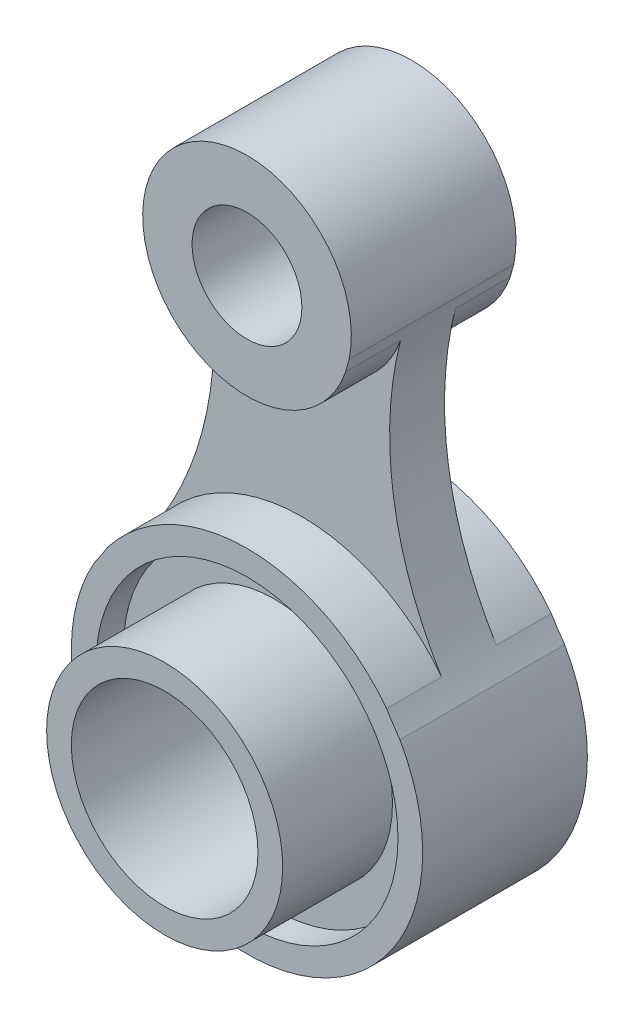
ISO-10303-21;
HEADER;
FILE_DESCRIPTION(('STEP AP214'),'2;1');
FILE_NAME('part.step','',(''),(''),'','','');
FILE_SCHEMA(('AUTOMOTIVE_DESIGN { 1 0 10303 214 1 1 1 1 }'));
ENDSEC;
DATA;
#1=APPLICATION_CONTEXT('core data for automotive mechanical design processes');
#2=APPLICATION_PROTOCOL_DEFINITION('international standard','automotive_design',2000,#1);
#3=PRODUCT_CONTEXT('',#1,'mechanical');
#4=PRODUCT('Part','Part','',(#3));
#5=PRODUCT_RELATED_PRODUCT_CATEGORY('part','',(#4));
#6=PRODUCT_DEFINITION_FORMATION('','',#4);
#7=PRODUCT_DEFINITION_CONTEXT('part definition',#1,'design');
#8=PRODUCT_DEFINITION('design','',#6,#7);
#9=PRODUCT_DEFINITION_SHAPE('','',#8);
#10=(LENGTH_UNIT() NAMED_UNIT(*) SI_UNIT(.MILLI.,.METRE.));
#11=(NAMED_UNIT(*) PLANE_ANGLE_UNIT() SI_UNIT($,.RADIAN.));
#12=(NAMED_UNIT(*) SI_UNIT($,.STERADIAN.) SOLID_ANGLE_UNIT());
#13=UNCERTAINTY_MEASURE_WITH_UNIT(LENGTH_MEASURE(1.E-05),#10,'distance_accuracy_value','');
#14=(GEOMETRIC_REPRESENTATION_CONTEXT(3) GLOBAL_UNCERTAINTY_ASSIGNED_CONTEXT((#13)) GLOBAL_UNIT_ASSIGNED_CONTEXT((#10,
#11,#12)) REPRESENTATION_CONTEXT('',''));
#15=CARTESIAN_POINT('',(0.,0.,0.));
#16=DIRECTION('',(0.,0.,1.));
#17=DIRECTION('',(1.,0.,0.));
#18=AXIS2_PLACEMENT_3D('',#15,#16,#17);
#19=CARTESIAN_POINT('',(80.2238614442222,52.9633260020108,10.));
#20=DIRECTION('',(0.,0.,-1.));
#21=DIRECTION('',(-1.,0.,0.));
#22=AXIS2_PLACEMENT_3D('',#19,#20,#21);
#23=CYLINDRICAL_SURFACE('',#22,64.2449236501036);
#24=CARTESIAN_POINT('',(80.2238614442222,52.9633260020108,0.));
#25=DIRECTION('',(0.,0.,1.));
#26=DIRECTION('',(1.,0.,0.));
#27=AXIS2_PLACEMENT_3D('',#24,#25,#26);
#28=CIRCLE('',#27,64.2449236501036);
#29=CARTESIAN_POINT('',(25.4209864442221,19.4363949384313,0.));
#30=VERTEX_POINT('',#29);
#31=CARTESIAN_POINT('',(17.9656021491115,68.816381365265,0.));
#32=VERTEX_POINT('',#31);
#33=EDGE_CURVE('E262',#30,#32,#28,.F.);
#34=ORIENTED_EDGE('',*,*,#33,.T.);
#35=DIRECTION('',(0.,0.,1.));
#36=VECTOR('',#35,1.);
#37=CARTESIAN_POINT('',(17.9656021491115,68.816381365265,-10.));
#38=LINE('',#37,#36);
#39=CARTESIAN_POINT('',(17.9656021491115,68.816381365265,-10.));
#40=VERTEX_POINT('',#39);
#41=EDGE_CURVE('E78',#40,#32,#38,.T.);
#42=ORIENTED_EDGE('',*,*,#41,.F.);
#43=CARTESIAN_POINT('',(80.2238614442222,52.9633260020108,-10.));
#44=DIRECTION('',(0.,0.,1.));
#45=DIRECTION('',(1.,0.,0.));
#46=AXIS2_PLACEMENT_3D('',#43,#44,#45);
#47=CIRCLE('',#46,64.2449236501036);
#48=CARTESIAN_POINT('',(18.6034567656696,71.1384722753991,-10.));
#49=VERTEX_POINT('',#48);
#50=EDGE_CURVE('E191',#40,#49,#47,.F.);
#51=ORIENTED_EDGE('',*,*,#50,.T.);
#52=DIRECTION('',(0.,0.,1.));
#53=VECTOR('',#52,1.);
#54=CARTESIAN_POINT('',(18.6034567656696,71.1384722753991,-10.));
#55=LINE('',#54,#53);
#56=CARTESIAN_POINT('',(18.6034567656696,71.1384722753991,20.));
#57=VERTEX_POINT('',#56);
#58=EDGE_CURVE('E161',#49,#57,#55,.T.);
#59=ORIENTED_EDGE('',*,*,#58,.T.);
#60=CARTESIAN_POINT('',(80.2238614442222,52.9633260020108,20.));
#61=DIRECTION('',(0.,0.,1.));
#62=DIRECTION('',(1.,0.,0.));
#63=AXIS2_PLACEMENT_3D('',#60,#61,#62);
#64=CIRCLE('',#63,64.2449236501036);
#65=CARTESIAN_POINT('',(17.9656021491115,68.816381365265,20.));
#66=VERTEX_POINT('',#65);
#67=EDGE_CURVE('E159',#66,#57,#64,.F.);
#68=ORIENTED_EDGE('',*,*,#67,.F.);
#69=CARTESIAN_POINT('',(17.9656021491115,68.816381365265,10.));
#70=VERTEX_POINT('',#69);
#71=EDGE_CURVE('E145',#70,#66,#38,.T.);
#72=ORIENTED_EDGE('',*,*,#71,.F.);
#73=CARTESIAN_POINT('',(80.2238614442222,52.9633260020108,10.));
#74=DIRECTION('',(0.,0.,1.));
#75=DIRECTION('',(1.,0.,0.));
#76=AXIS2_PLACEMENT_3D('',#73,#74,#75);
#77=CIRCLE('',#76,64.2449236501036);
#78=CARTESIAN_POINT('',(25.4209864442221,19.4363949384313,10.));
#79=VERTEX_POINT('',#78);
#80=EDGE_CURVE('E255',#79,#70,#77,.F.);
#81=ORIENTED_EDGE('',*,*,#80,.F.);
#82=DIRECTION('',(0.,0.,1.));
#83=VECTOR('',#82,1.);
#84=CARTESIAN_POINT('',(25.4209864442221,19.4363949384313,-10.));
#85=LINE('',#84,#83);
#86=CARTESIAN_POINT('',(25.4209864442221,19.4363949384313,20.));
#87=VERTEX_POINT('',#86);
#88=EDGE_CURVE('E249',#79,#87,#85,.T.);
#89=ORIENTED_EDGE('',*,*,#88,.T.);
#90=CARTESIAN_POINT('',(80.2238614442222,52.9633260020108,20.));
#91=DIRECTION('',(0.,0.,1.));
#92=DIRECTION('',(1.,0.,0.));
#93=AXIS2_PLACEMENT_3D('',#90,#91,#92);
#94=CIRCLE('',#93,64.2449236501036);
#95=CARTESIAN_POINT('',(27.86119767388,15.7401926346847,20.));
#96=VERTEX_POINT('',#95);
#97=EDGE_CURVE('E216',#96,#87,#94,.F.);
#98=ORIENTED_EDGE('',*,*,#97,.F.);
#99=DIRECTION('',(0.,0.,1.));
#100=VECTOR('',#99,1.);
#101=CARTESIAN_POINT('',(27.86119767388,15.7401926346847,-10.));
#102=LINE('',#101,#100);
#103=CARTESIAN_POINT('',(27.86119767388,15.7401926346847,-10.));
#104=VERTEX_POINT('',#103);
#105=EDGE_CURVE('E237',#104,#96,#102,.T.);
#106=ORIENTED_EDGE('',*,*,#105,.F.);
#107=CARTESIAN_POINT('',(80.2238614442222,52.9633260020108,-10.));
#108=DIRECTION('',(0.,0.,1.));
#109=DIRECTION('',(1.,0.,0.));
#110=AXIS2_PLACEMENT_3D('',#107,#108,#109);
#111=CIRCLE('',#110,64.2449236501036);
#112=CARTESIAN_POINT('',(25.4209864442221,19.4363949384313,-10.));
#113=VERTEX_POINT('',#112);
#114=EDGE_CURVE('E229',#104,#113,#111,.F.);
#115=ORIENTED_EDGE('',*,*,#114,.T.);
#116=EDGE_CURVE('E245',#113,#30,#85,.T.);
#117=ORIENTED_EDGE('',*,*,#116,.T.);
#118=EDGE_LOOP('',(#34,#42,#51,#59,#68,#72,#81,#89,#98,#106,#115,#117));
#119=FACE_BOUND('',#118,.T.);
#120=ADVANCED_FACE('F53',(#119),#23,.F.);
#121=CARTESIAN_POINT('',(-80.2238614442222,52.9633260020108,10.));
#122=DIRECTION('',(0.,0.,-1.));
#123=DIRECTION('',(-1.,0.,0.));
#124=AXIS2_PLACEMENT_3D('',#121,#122,#123);
#125=CYLINDRICAL_SURFACE('',#124,64.2449236501036);
#126=CARTESIAN_POINT('',(-80.2238614442222,52.9633260020108,0.));
#127=DIRECTION('',(0.,0.,1.));
#128=DIRECTION('',(1.,0.,0.));
#129=AXIS2_PLACEMENT_3D('',#126,#127,#128);
#130=CIRCLE('',#129,64.2449236501036);
#131=CARTESIAN_POINT('',(-25.4209864442221,19.4363949384313,0.));
#132=VERTEX_POINT('',#131);
#133=CARTESIAN_POINT('',(-17.9656021491115,68.816381365265,0.));
#134=VERTEX_POINT('',#133);
#135=EDGE_CURVE('E56',#132,#134,#130,.T.);
#136=ORIENTED_EDGE('',*,*,#135,.F.);
#137=DIRECTION('',(0.,0.,1.));
#138=VECTOR('',#137,1.);
#139=CARTESIAN_POINT('',(-25.4209864442221,19.4363949384313,-10.));
#140=LINE('',#139,#138);
#141=CARTESIAN_POINT('',(-25.4209864442221,19.4363949384313,-10.));
#142=VERTEX_POINT('',#141);
#143=EDGE_CURVE('E70',#142,#132,#140,.T.);
#144=ORIENTED_EDGE('',*,*,#143,.F.);
#145=CARTESIAN_POINT('',(-80.2238614442222,52.9633260020108,-10.));
#146=DIRECTION('',(0.,0.,1.));
#147=DIRECTION('',(1.,0.,0.));
#148=AXIS2_PLACEMENT_3D('',#145,#146,#147);
#149=CIRCLE('',#148,64.2449236501036);
#150=CARTESIAN_POINT('',(-27.86119767388,15.7401926346847,-10.));
#151=VERTEX_POINT('',#150);
#152=EDGE_CURVE('E234',#151,#142,#149,.T.);
#153=ORIENTED_EDGE('',*,*,#152,.F.);
#154=DIRECTION('',(0.,0.,1.));
#155=VECTOR('',#154,1.);
#156=CARTESIAN_POINT('',(-27.86119767388,15.7401926346847,-10.));
#157=LINE('',#156,#155);
#158=CARTESIAN_POINT('',(-27.86119767388,15.7401926346847,20.));
#159=VERTEX_POINT('',#158);
#160=EDGE_CURVE('E238',#151,#159,#157,.T.);
#161=ORIENTED_EDGE('',*,*,#160,.T.);
#162=CARTESIAN_POINT('',(-80.2238614442222,52.9633260020108,20.));
#163=DIRECTION('',(0.,0.,1.));
#164=DIRECTION('',(1.,0.,0.));
#165=AXIS2_PLACEMENT_3D('',#162,#163,#164);
#166=CIRCLE('',#165,64.2449236501036);
#167=CARTESIAN_POINT('',(-25.4209864442221,19.4363949384313,20.));
#168=VERTEX_POINT('',#167);
#169=EDGE_CURVE('E221',#159,#168,#166,.T.);
#170=ORIENTED_EDGE('',*,*,#169,.T.);
#171=CARTESIAN_POINT('',(-25.4209864442221,19.4363949384313,10.));
#172=VERTEX_POINT('',#171);
#173=EDGE_CURVE('E244',#172,#168,#140,.T.);
#174=ORIENTED_EDGE('',*,*,#173,.F.);
#175=CARTESIAN_POINT('',(-80.2238614442222,52.9633260020108,10.));
#176=DIRECTION('',(0.,0.,1.));
#177=DIRECTION('',(1.,0.,0.));
#178=AXIS2_PLACEMENT_3D('',#175,#176,#177);
#179=CIRCLE('',#178,64.2449236501036);
#180=CARTESIAN_POINT('',(-17.9656021491115,68.816381365265,10.));
#181=VERTEX_POINT('',#180);
#182=EDGE_CURVE('E11',#172,#181,#179,.T.);
#183=ORIENTED_EDGE('',*,*,#182,.T.);
#184=DIRECTION('',(0.,0.,1.));
#185=VECTOR('',#184,1.);
#186=CARTESIAN_POINT('',(-17.9656021491115,68.816381365265,-10.));
#187=LINE('',#186,#185);
#188=CARTESIAN_POINT('',(-17.9656021491115,68.816381365265,20.));
#189=VERTEX_POINT('',#188);
#190=EDGE_CURVE('E202',#181,#189,#187,.T.);
#191=ORIENTED_EDGE('',*,*,#190,.T.);
#192=CARTESIAN_POINT('',(-80.2238614442222,52.9633260020108,20.));
#193=DIRECTION('',(0.,0.,1.));
#194=DIRECTION('',(1.,0.,0.));
#195=AXIS2_PLACEMENT_3D('',#192,#193,#194);
#196=CIRCLE('',#195,64.2449236501036);
#197=CARTESIAN_POINT('',(-18.6034567656696,71.1384722753991,20.));
#198=VERTEX_POINT('',#197);
#199=EDGE_CURVE('E170',#189,#198,#196,.T.);
#200=ORIENTED_EDGE('',*,*,#199,.T.);
#201=DIRECTION('',(0.,0.,1.));
#202=VECTOR('',#201,1.);
#203=CARTESIAN_POINT('',(-18.6034567656696,71.1384722753991,-10.));
#204=LINE('',#203,#202);
#205=CARTESIAN_POINT('',(-18.6034567656696,71.1384722753991,-10.));
#206=VERTEX_POINT('',#205);
#207=EDGE_CURVE('E203',#206,#198,#204,.T.);
#208=ORIENTED_EDGE('',*,*,#207,.F.);
#209=CARTESIAN_POINT('',(-80.2238614442222,52.9633260020108,-10.));
#210=DIRECTION('',(0.,0.,1.));
#211=DIRECTION('',(1.,0.,0.));
#212=AXIS2_PLACEMENT_3D('',#209,#210,#211);
#213=CIRCLE('',#212,64.2449236501036);
#214=CARTESIAN_POINT('',(-17.9656021491115,68.816381365265,-10.));
#215=VERTEX_POINT('',#214);
#216=EDGE_CURVE('E156',#215,#206,#213,.T.);
#217=ORIENTED_EDGE('',*,*,#216,.F.);
#218=EDGE_CURVE('E197',#215,#134,#187,.T.);
#219=ORIENTED_EDGE('',*,*,#218,.T.);
#220=EDGE_LOOP('',(#136,#144,#153,#161,#170,#174,#183,#191,#200,#208,#217,#219));
#221=FACE_BOUND('',#220,.T.);
#222=ADVANCED_FACE('F273',(#221),#125,.F.);
#223=CARTESIAN_POINT('',(0.,0.,10.));
#224=DIRECTION('',(0.,0.,1.));
#225=DIRECTION('',(1.,0.,0.));
#226=AXIS2_PLACEMENT_3D('',#223,#224,#225);
#227=PLANE('',#226);
#228=CARTESIAN_POINT('',(0.,0.,10.));
#229=DIRECTION('',(0.,0.,1.));
#230=DIRECTION('',(1.,0.,0.));
#231=AXIS2_PLACEMENT_3D('',#228,#229,#230);
#232=CIRCLE('',#231,32.);
#233=EDGE_CURVE('E252',#79,#172,#232,.T.);
#234=ORIENTED_EDGE('',*,*,#233,.F.);
#235=ORIENTED_EDGE('',*,*,#80,.T.);
#236=CARTESIAN_POINT('',(0.,75.,10.));
#237=DIRECTION('',(0.,0.,1.));
#238=DIRECTION('',(1.,0.,0.));
#239=AXIS2_PLACEMENT_3D('',#236,#237,#238);
#240=CIRCLE('',#239,19.);
#241=EDGE_CURVE('E62',#181,#70,#240,.T.);
#242=ORIENTED_EDGE('',*,*,#241,.F.);
#243=ORIENTED_EDGE('',*,*,#182,.F.);
#244=EDGE_LOOP('',(#234,#235,#242,#243));
#245=FACE_BOUND('',#244,.T.);
#246=ADVANCED_FACE('F313',(#245),#227,.T.);
#247=CARTESIAN_POINT('',(0.,0.,0.));
#248=DIRECTION('',(0.,0.,1.));
#249=DIRECTION('',(1.,0.,0.));
#250=AXIS2_PLACEMENT_3D('',#247,#248,#249);
#251=PLANE('',#250);
#252=CARTESIAN_POINT('',(0.,0.,0.));
#253=DIRECTION('',(0.,0.,1.));
#254=DIRECTION('',(1.,0.,0.));
#255=AXIS2_PLACEMENT_3D('',#252,#253,#254);
#256=CIRCLE('',#255,32.);
#257=EDGE_CURVE('E241',#30,#132,#256,.T.);
#258=ORIENTED_EDGE('',*,*,#257,.T.);
#259=ORIENTED_EDGE('',*,*,#135,.T.);
#260=CARTESIAN_POINT('',(0.,75.,0.));
#261=DIRECTION('',(0.,0.,1.));
#262=DIRECTION('',(1.,0.,0.));
#263=AXIS2_PLACEMENT_3D('',#260,#261,#262);
#264=CIRCLE('',#263,19.);
#265=EDGE_CURVE('E264',#134,#32,#264,.T.);
#266=ORIENTED_EDGE('',*,*,#265,.T.);
#267=ORIENTED_EDGE('',*,*,#33,.F.);
#268=EDGE_LOOP('',(#258,#259,#266,#267));
#269=FACE_BOUND('',#268,.T.);
#270=ADVANCED_FACE('F272',(#269),#251,.F.);
#271=CARTESIAN_POINT('',(0.,0.,-10.));
#272=DIRECTION('',(0.,0.,1.));
#273=DIRECTION('',(1.,0.,0.));
#274=AXIS2_PLACEMENT_3D('',#271,#272,#273);
#275=CYLINDRICAL_SURFACE('',#274,32.);
#276=ORIENTED_EDGE('',*,*,#257,.F.);
#277=ORIENTED_EDGE('',*,*,#116,.F.);
#278=CARTESIAN_POINT('',(0.,0.,-10.));
#279=DIRECTION('',(0.,0.,1.));
#280=DIRECTION('',(1.,0.,0.));
#281=AXIS2_PLACEMENT_3D('',#278,#279,#280);
#282=CIRCLE('',#281,32.);
#283=EDGE_CURVE('E230',#113,#142,#282,.T.);
#284=ORIENTED_EDGE('',*,*,#283,.T.);
#285=ORIENTED_EDGE('',*,*,#143,.T.);
#286=EDGE_LOOP('',(#276,#277,#284,#285));
#287=FACE_BOUND('',#286,.T.);
#288=ADVANCED_FACE('F285',(#287),#275,.T.);
#289=ORIENTED_EDGE('',*,*,#105,.T.);
#290=CARTESIAN_POINT('',(0.,0.,20.));
#291=DIRECTION('',(0.,0.,1.));
#292=DIRECTION('',(1.,0.,0.));
#293=AXIS2_PLACEMENT_3D('',#290,#291,#292);
#294=CIRCLE('',#293,32.);
#295=EDGE_CURVE('E212',#159,#96,#294,.T.);
#296=ORIENTED_EDGE('',*,*,#295,.F.);
#297=ORIENTED_EDGE('',*,*,#160,.F.);
#298=EDGE_CURVE('E225',#151,#104,#282,.T.);
#299=ORIENTED_EDGE('',*,*,#298,.T.);
#300=EDGE_LOOP('',(#289,#296,#297,#299));
#301=FACE_BOUND('',#300,.T.);
#302=ADVANCED_FACE('F329',(#301),#275,.T.);
#303=ORIENTED_EDGE('',*,*,#88,.F.);
#304=ORIENTED_EDGE('',*,*,#233,.T.);
#305=ORIENTED_EDGE('',*,*,#173,.T.);
#306=EDGE_CURVE('E217',#87,#168,#294,.T.);
#307=ORIENTED_EDGE('',*,*,#306,.F.);
#308=EDGE_LOOP('',(#303,#304,#305,#307));
#309=FACE_BOUND('',#308,.T.);
#310=ADVANCED_FACE('F325',(#309),#275,.T.);
#311=CARTESIAN_POINT('',(0.,0.,-10.));
#312=DIRECTION('',(0.,0.,1.));
#313=DIRECTION('',(1.,0.,0.));
#314=AXIS2_PLACEMENT_3D('',#311,#312,#313);
#315=CYLINDRICAL_SURFACE('',#314,27.5);
#316=CARTESIAN_POINT('',(0.,0.,15.));
#317=DIRECTION('',(0.,0.,1.));
#318=DIRECTION('',(1.,0.,0.));
#319=AXIS2_PLACEMENT_3D('',#316,#317,#318);
#320=CIRCLE('',#319,27.5);
#321=CARTESIAN_POINT('',(27.5,0.,15.));
#322=VERTEX_POINT('',#321);
#323=EDGE_CURVE('E176',#322,#322,#320,.T.);
#324=ORIENTED_EDGE('',*,*,#323,.F.);
#325=EDGE_LOOP('',(#324));
#326=FACE_BOUND('',#325,.T.);
#327=CARTESIAN_POINT('',(0.,0.,20.));
#328=DIRECTION('',(0.,0.,1.));
#329=DIRECTION('',(1.,0.,0.));
#330=AXIS2_PLACEMENT_3D('',#327,#328,#329);
#331=CIRCLE('',#330,27.5);
#332=CARTESIAN_POINT('',(27.5,0.,20.));
#333=VERTEX_POINT('',#332);
#334=EDGE_CURVE('E201',#333,#333,#331,.T.);
#335=ORIENTED_EDGE('',*,*,#334,.T.);
#336=EDGE_LOOP('',(#335));
#337=FACE_BOUND('',#336,.T.);
#338=ADVANCED_FACE('F322',(#326,#337),#315,.F.);
#339=CARTESIAN_POINT('',(0.,0.,-10.));
#340=DIRECTION('',(0.,0.,1.));
#341=DIRECTION('',(1.,0.,0.));
#342=AXIS2_PLACEMENT_3D('',#339,#340,#341);
#343=PLANE('',#342);
#344=ORIENTED_EDGE('',*,*,#298,.F.);
#345=ORIENTED_EDGE('',*,*,#152,.T.);
#346=ORIENTED_EDGE('',*,*,#283,.F.);
#347=ORIENTED_EDGE('',*,*,#114,.F.);
#348=EDGE_LOOP('',(#344,#345,#346,#347));
#349=FACE_BOUND('',#348,.T.);
#350=CARTESIAN_POINT('',(0.,0.,-10.));
#351=DIRECTION('',(0.,0.,1.));
#352=DIRECTION('',(1.,0.,0.));
#353=AXIS2_PLACEMENT_3D('',#350,#351,#352);
#354=CIRCLE('',#353,17.);
#355=CARTESIAN_POINT('',(17.,0.,-10.));
#356=VERTEX_POINT('',#355);
#357=EDGE_CURVE('E591',#356,#356,#354,.T.);
#358=ORIENTED_EDGE('',*,*,#357,.T.);
#359=EDGE_LOOP('',(#358));
#360=FACE_BOUND('',#359,.T.);
#361=ADVANCED_FACE('F288',(#349,#360),#343,.F.);
#362=CARTESIAN_POINT('',(0.,0.,20.));
#363=DIRECTION('',(0.,0.,1.));
#364=DIRECTION('',(1.,0.,0.));
#365=AXIS2_PLACEMENT_3D('',#362,#363,#364);
#366=PLANE('',#365);
#367=ORIENTED_EDGE('',*,*,#334,.F.);
#368=EDGE_LOOP('',(#367));
#369=FACE_BOUND('',#368,.T.);
#370=ORIENTED_EDGE('',*,*,#295,.T.);
#371=ORIENTED_EDGE('',*,*,#97,.T.);
#372=ORIENTED_EDGE('',*,*,#306,.T.);
#373=ORIENTED_EDGE('',*,*,#169,.F.);
#374=EDGE_LOOP('',(#370,#371,#372,#373));
#375=FACE_BOUND('',#374,.T.);
#376=ADVANCED_FACE('F308',(#369,#375),#366,.T.);
#377=CARTESIAN_POINT('',(0.,75.,-10.));
#378=DIRECTION('',(0.,0.,1.));
#379=DIRECTION('',(1.,0.,0.));
#380=AXIS2_PLACEMENT_3D('',#377,#378,#379);
#381=CYLINDRICAL_SURFACE('',#380,19.);
#382=ORIENTED_EDGE('',*,*,#265,.F.);
#383=ORIENTED_EDGE('',*,*,#218,.F.);
#384=CARTESIAN_POINT('',(0.,75.,-10.));
#385=DIRECTION('',(0.,0.,1.));
#386=DIRECTION('',(1.,0.,0.));
#387=AXIS2_PLACEMENT_3D('',#384,#385,#386);
#388=CIRCLE('',#387,19.);
#389=EDGE_CURVE('E186',#215,#40,#388,.T.);
#390=ORIENTED_EDGE('',*,*,#389,.T.);
#391=ORIENTED_EDGE('',*,*,#41,.T.);
#392=EDGE_LOOP('',(#382,#383,#390,#391));
#393=FACE_BOUND('',#392,.T.);
#394=ADVANCED_FACE('F277',(#393),#381,.T.);
#395=ORIENTED_EDGE('',*,*,#190,.F.);
#396=ORIENTED_EDGE('',*,*,#241,.T.);
#397=ORIENTED_EDGE('',*,*,#71,.T.);
#398=CARTESIAN_POINT('',(0.,75.,20.));
#399=DIRECTION('',(0.,0.,1.));
#400=DIRECTION('',(1.,0.,0.));
#401=AXIS2_PLACEMENT_3D('',#398,#399,#400);
#402=CIRCLE('',#401,19.);
#403=EDGE_CURVE('E149',#189,#66,#402,.T.);
#404=ORIENTED_EDGE('',*,*,#403,.F.);
#405=EDGE_LOOP('',(#395,#396,#397,#404));
#406=FACE_BOUND('',#405,.T.);
#407=ADVANCED_FACE('F147',(#406),#381,.T.);
#408=ORIENTED_EDGE('',*,*,#207,.T.);
#409=EDGE_CURVE('E166',#57,#198,#402,.T.);
#410=ORIENTED_EDGE('',*,*,#409,.F.);
#411=ORIENTED_EDGE('',*,*,#58,.F.);
#412=EDGE_CURVE('E192',#49,#206,#388,.T.);
#413=ORIENTED_EDGE('',*,*,#412,.T.);
#414=EDGE_LOOP('',(#408,#410,#411,#413));
#415=FACE_BOUND('',#414,.T.);
#416=ADVANCED_FACE('F296',(#415),#381,.T.);
#417=CARTESIAN_POINT('',(0.,75.,-10.));
#418=DIRECTION('',(0.,0.,1.));
#419=DIRECTION('',(1.,0.,0.));
#420=AXIS2_PLACEMENT_3D('',#417,#418,#419);
#421=CYLINDRICAL_SURFACE('',#420,10.);
#422=CARTESIAN_POINT('',(0.,75.,-10.));
#423=DIRECTION('',(0.,0.,1.));
#424=DIRECTION('',(1.,0.,0.));
#425=AXIS2_PLACEMENT_3D('',#422,#423,#424);
#426=CIRCLE('',#425,10.);
#427=CARTESIAN_POINT('',(10.,75.,-10.));
#428=VERTEX_POINT('',#427);
#429=EDGE_CURVE('E180',#428,#428,#426,.T.);
#430=ORIENTED_EDGE('',*,*,#429,.F.);
#431=EDGE_LOOP('',(#430));
#432=FACE_BOUND('',#431,.T.);
#433=CARTESIAN_POINT('',(0.,75.,20.));
#434=DIRECTION('',(0.,0.,1.));
#435=DIRECTION('',(1.,0.,0.));
#436=AXIS2_PLACEMENT_3D('',#433,#434,#435);
#437=CIRCLE('',#436,10.);
#438=CARTESIAN_POINT('',(10.,75.,20.));
#439=VERTEX_POINT('',#438);
#440=EDGE_CURVE('E172',#439,#439,#437,.T.);
#441=ORIENTED_EDGE('',*,*,#440,.T.);
#442=EDGE_LOOP('',(#441));
#443=FACE_BOUND('',#442,.T.);
#444=ADVANCED_FACE('F298',(#432,#443),#421,.F.);
#445=CARTESIAN_POINT('',(0.,0.,-10.));
#446=DIRECTION('',(0.,0.,1.));
#447=DIRECTION('',(1.,0.,0.));
#448=AXIS2_PLACEMENT_3D('',#445,#446,#447);
#449=PLANE('',#448);
#450=ORIENTED_EDGE('',*,*,#429,.T.);
#451=EDGE_LOOP('',(#450));
#452=FACE_BOUND('',#451,.T.);
#453=ORIENTED_EDGE('',*,*,#389,.F.);
#454=ORIENTED_EDGE('',*,*,#216,.T.);
#455=ORIENTED_EDGE('',*,*,#412,.F.);
#456=ORIENTED_EDGE('',*,*,#50,.F.);
#457=EDGE_LOOP('',(#453,#454,#455,#456));
#458=FACE_BOUND('',#457,.T.);
#459=ADVANCED_FACE('F280',(#452,#458),#449,.F.);
#460=CARTESIAN_POINT('',(0.,0.,20.));
#461=DIRECTION('',(0.,0.,1.));
#462=DIRECTION('',(1.,0.,0.));
#463=AXIS2_PLACEMENT_3D('',#460,#461,#462);
#464=PLANE('',#463);
#465=ORIENTED_EDGE('',*,*,#440,.F.);
#466=EDGE_LOOP('',(#465));
#467=FACE_BOUND('',#466,.T.);
#468=ORIENTED_EDGE('',*,*,#403,.T.);
#469=ORIENTED_EDGE('',*,*,#67,.T.);
#470=ORIENTED_EDGE('',*,*,#409,.T.);
#471=ORIENTED_EDGE('',*,*,#199,.F.);
#472=EDGE_LOOP('',(#468,#469,#470,#471));
#473=FACE_BOUND('',#472,.T.);
#474=ADVANCED_FACE('F168',(#467,#473),#464,.T.);
#475=CARTESIAN_POINT('',(0.,0.,15.));
#476=DIRECTION('',(0.,0.,1.));
#477=DIRECTION('',(1.,0.,0.));
#478=AXIS2_PLACEMENT_3D('',#475,#476,#477);
#479=PLANE('',#478);
#480=CARTESIAN_POINT('',(0.,0.,15.));
#481=DIRECTION('',(0.,0.,1.));
#482=DIRECTION('',(1.,0.,0.));
#483=AXIS2_PLACEMENT_3D('',#480,#481,#482);
#484=CIRCLE('',#483,21.5);
#485=CARTESIAN_POINT('',(21.5,0.,15.));
#486=VERTEX_POINT('',#485);
#487=EDGE_CURVE('E596',#486,#486,#484,.T.);
#488=ORIENTED_EDGE('',*,*,#487,.F.);
#489=EDGE_LOOP('',(#488));
#490=FACE_BOUND('',#489,.T.);
#491=ORIENTED_EDGE('',*,*,#323,.T.);
#492=EDGE_LOOP('',(#491));
#493=FACE_BOUND('',#492,.T.);
#494=ADVANCED_FACE('F485',(#490,#493),#479,.T.);
#495=CARTESIAN_POINT('',(0.,0.,-10.));
#496=DIRECTION('',(0.,0.,1.));
#497=DIRECTION('',(1.,0.,0.));
#498=AXIS2_PLACEMENT_3D('',#495,#496,#497);
#499=CYLINDRICAL_SURFACE('',#498,17.);
#500=ORIENTED_EDGE('',*,*,#357,.F.);
#501=EDGE_LOOP('',(#500));
#502=FACE_BOUND('',#501,.T.);
#503=CARTESIAN_POINT('',(0.,0.,35.));
#504=DIRECTION('',(0.,0.,1.));
#505=DIRECTION('',(1.,0.,0.));
#506=AXIS2_PLACEMENT_3D('',#503,#504,#505);
#507=CIRCLE('',#506,17.);
#508=CARTESIAN_POINT('',(17.,0.,35.));
#509=VERTEX_POINT('',#508);
#510=EDGE_CURVE('E585',#509,#509,#507,.T.);
#511=ORIENTED_EDGE('',*,*,#510,.T.);
#512=EDGE_LOOP('',(#511));
#513=FACE_BOUND('',#512,.T.);
#514=ADVANCED_FACE('F505',(#502,#513),#499,.F.);
#515=CARTESIAN_POINT('',(0.,0.,-10.));
#516=DIRECTION('',(0.,0.,1.));
#517=DIRECTION('',(1.,0.,0.));
#518=AXIS2_PLACEMENT_3D('',#515,#516,#517);
#519=CYLINDRICAL_SURFACE('',#518,21.5);
#520=ORIENTED_EDGE('',*,*,#487,.T.);
#521=EDGE_LOOP('',(#520));
#522=FACE_BOUND('',#521,.T.);
#523=CARTESIAN_POINT('',(0.,0.,35.));
#524=DIRECTION('',(0.,0.,1.));
#525=DIRECTION('',(1.,0.,0.));
#526=AXIS2_PLACEMENT_3D('',#523,#524,#525);
#527=CIRCLE('',#526,21.5);
#528=CARTESIAN_POINT('',(21.5,0.,35.));
#529=VERTEX_POINT('',#528);
#530=EDGE_CURVE('E588',#529,#529,#527,.T.);
#531=ORIENTED_EDGE('',*,*,#530,.F.);
#532=EDGE_LOOP('',(#531));
#533=FACE_BOUND('',#532,.T.);
#534=ADVANCED_FACE('F524',(#522,#533),#519,.T.);
#535=CARTESIAN_POINT('',(0.,0.,35.));
#536=DIRECTION('',(0.,0.,1.));
#537=DIRECTION('',(1.,0.,0.));
#538=AXIS2_PLACEMENT_3D('',#535,#536,#537);
#539=PLANE('',#538);
#540=ORIENTED_EDGE('',*,*,#510,.F.);
#541=EDGE_LOOP('',(#540));
#542=FACE_BOUND('',#541,.T.);
#543=ORIENTED_EDGE('',*,*,#530,.T.);
#544=EDGE_LOOP('',(#543));
#545=FACE_BOUND('',#544,.T.);
#546=ADVANCED_FACE('F536',(#542,#545),#539,.T.);
#547=CLOSED_SHELL('',(#120,#222,#246,#270,#288,#302,#310,#338,#361,#376,#394,#407,#416,#444,
#459,#474,#494,#514,#534,#546));
#548=MANIFOLD_SOLID_BREP('B2',#547);
#549=ADVANCED_BREP_SHAPE_REPRESENTATION('',(#18,#548),#14);
#550=SHAPE_DEFINITION_REPRESENTATION(#9,#549);
ENDSEC;
END-ISO-10303-21;
